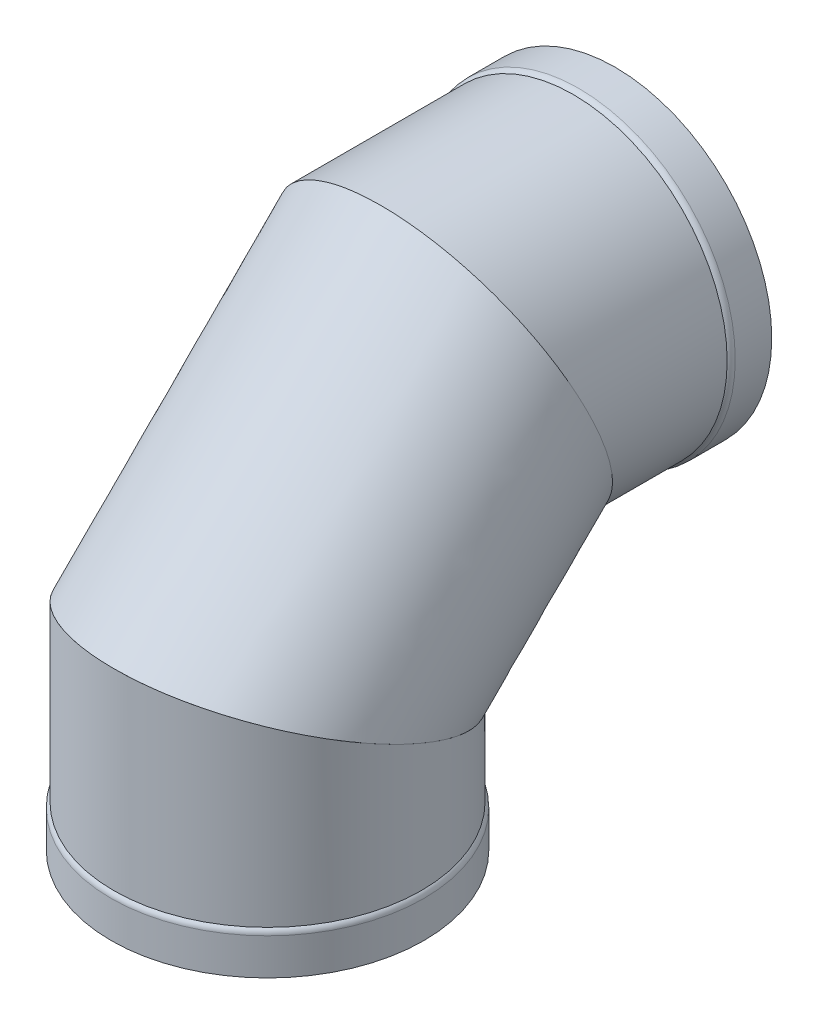
ISO-10303-21;
HEADER;
FILE_DESCRIPTION(('STEP AP214'),'2;1');
FILE_NAME('part.step','',(''),(''),'','','');
FILE_SCHEMA(('AUTOMOTIVE_DESIGN { 1 0 10303 214 1 1 1 1 }'));
ENDSEC;
DATA;
#1=APPLICATION_CONTEXT('core data for automotive mechanical design processes');
#2=APPLICATION_PROTOCOL_DEFINITION('international standard','automotive_design',2000,#1);
#3=PRODUCT_CONTEXT('',#1,'mechanical');
#4=PRODUCT('Part','Part','',(#3));
#5=PRODUCT_RELATED_PRODUCT_CATEGORY('part','',(#4));
#6=PRODUCT_DEFINITION_FORMATION('','',#4);
#7=PRODUCT_DEFINITION_CONTEXT('part definition',#1,'design');
#8=PRODUCT_DEFINITION('design','',#6,#7);
#9=PRODUCT_DEFINITION_SHAPE('','',#8);
#10=(LENGTH_UNIT() NAMED_UNIT(*) SI_UNIT(.MILLI.,.METRE.));
#11=(NAMED_UNIT(*) PLANE_ANGLE_UNIT() SI_UNIT($,.RADIAN.));
#12=(NAMED_UNIT(*) SI_UNIT($,.STERADIAN.) SOLID_ANGLE_UNIT());
#13=UNCERTAINTY_MEASURE_WITH_UNIT(LENGTH_MEASURE(1.E-05),#10,'distance_accuracy_value','');
#14=(GEOMETRIC_REPRESENTATION_CONTEXT(3) GLOBAL_UNCERTAINTY_ASSIGNED_CONTEXT((#13)) GLOBAL_UNIT_ASSIGNED_CONTEXT((#10,
#11,#12)) REPRESENTATION_CONTEXT('',''));
#15=CARTESIAN_POINT('',(0.,0.,0.));
#16=DIRECTION('',(0.,0.,1.));
#17=DIRECTION('',(1.,0.,0.));
#18=AXIS2_PLACEMENT_3D('',#15,#16,#17);
#19=CARTESIAN_POINT('',(0.,631.535476791397,-323.560476791396));
#20=DIRECTION('',(0.,-0.387588639363088,0.921832439566253));
#21=DIRECTION('',(0.,-0.921832439566253,-0.387588639363088));
#22=AXIS2_PLACEMENT_3D('',#19,#20,#21);
#23=PLANE('',#22);
#24=CARTESIAN_POINT('',(0.,631.535476791397,-323.560476791396));
#25=DIRECTION('',(0.,-0.387588639363088,0.921832439566253));
#26=DIRECTION('',(0.,-0.921832439566253,-0.387588639363088));
#27=AXIS2_PLACEMENT_3D('',#24,#25,#26);
#28=ELLIPSE('',#27,297.925618813354,274.6375);
#29=CARTESIAN_POINT('',(0.,356.897976791398,-439.03306201867));
#30=VERTEX_POINT('',#29);
#31=EDGE_CURVE('E91',#30,#30,#28,.T.);
#32=ORIENTED_EDGE('',*,*,#31,.T.);
#33=EDGE_LOOP('',(#32));
#34=FACE_BOUND('',#33,.T.);
#35=CARTESIAN_POINT('',(0.,631.535476791397,-323.560476791396));
#36=DIRECTION('',(0.,-0.387588639363088,0.921832439566253));
#37=DIRECTION('',(0.,-0.921832439566253,-0.387588639363088));
#38=AXIS2_PLACEMENT_3D('',#35,#36,#37);
#39=ELLIPSE('',#38,303.09195902399,279.4);
#40=CARTESIAN_POINT('',(0.,352.135476791397,-441.035476791397));
#41=VERTEX_POINT('',#40);
#42=EDGE_CURVE('E12',#41,#41,#39,.T.);
#43=ORIENTED_EDGE('',*,*,#42,.F.);
#44=EDGE_LOOP('',(#43));
#45=FACE_BOUND('',#44,.T.);
#46=ADVANCED_FACE('F74',(#34,#45),#23,.F.);
#47=CARTESIAN_POINT('',(0.,307.975,0.));
#48=DIRECTION('',(0.,0.921832439566255,-0.387588639363085));
#49=DIRECTION('',(0.,0.387588639363085,0.921832439566255));
#50=AXIS2_PLACEMENT_3D('',#47,#48,#49);
#51=PLANE('',#50);
#52=CARTESIAN_POINT('',(0.,307.975,0.));
#53=DIRECTION('',(0.,0.921832439566255,-0.387588639363085));
#54=DIRECTION('',(0.,-0.387588639363085,-0.921832439566255));
#55=AXIS2_PLACEMENT_3D('',#52,#53,#54);
#56=ELLIPSE('',#55,297.925618813354,274.6375);
#57=CARTESIAN_POINT('',(0.,192.502414772727,-274.6375));
#58=VERTEX_POINT('',#57);
#59=EDGE_CURVE('E105',#58,#58,#56,.T.);
#60=ORIENTED_EDGE('',*,*,#59,.T.);
#61=EDGE_LOOP('',(#60));
#62=FACE_BOUND('',#61,.T.);
#63=CARTESIAN_POINT('',(0.,307.975,0.));
#64=DIRECTION('',(0.,0.921832439566255,-0.387588639363085));
#65=DIRECTION('',(0.,-0.387588639363085,-0.921832439566255));
#66=AXIS2_PLACEMENT_3D('',#63,#64,#65);
#67=ELLIPSE('',#66,303.09195902399,279.4);
#68=CARTESIAN_POINT('',(0.,190.5,-279.4));
#69=VERTEX_POINT('',#68);
#70=EDGE_CURVE('E83',#69,#69,#67,.T.);
#71=ORIENTED_EDGE('',*,*,#70,.F.);
#72=EDGE_LOOP('',(#71));
#73=FACE_BOUND('',#72,.T.);
#74=ADVANCED_FACE('F113',(#62,#73),#51,.F.);
#75=CARTESIAN_POINT('',(0.0350124467390382,425.449999077625,279.399997806243));
#76=CARTESIAN_POINT('',(0.112525700537139,910.935454132066,-206.085486318613));
#77=CARTESIAN_POINT('',(558.835008059225,425.420556792867,279.329972912765));
#78=CARTESIAN_POINT('',(558.912480381876,910.710402730992,-206.180110203156));
#79=CARTESIAN_POINT('',(558.764983165747,190.470558637617,-279.470022699721));
#80=CARTESIAN_POINT('',(558.687428980802,351.910448049653,-441.130091148721));
#81=CARTESIAN_POINT('',(-0.0350124467391965,190.500000922375,-279.399997806243));
#82=CARTESIAN_POINT('',(-0.112525700537173,352.135499450728,-441.035467264178));
#83=CARTESIAN_POINT('',(-558.835008059225,190.529443207133,-279.329972912765));
#84=CARTESIAN_POINT('',(-558.912480381876,352.360550851802,-440.940843379636));
#85=CARTESIAN_POINT('',(-558.764983165747,425.479441362383,279.470022699721));
#86=CARTESIAN_POINT('',(-558.687428980802,911.160505533141,-205.99086243407));
#87=CARTESIAN_POINT('',(0.0350124467390382,425.449999077625,279.399997806243));
#88=CARTESIAN_POINT('',(0.112525700537139,910.935454132066,-206.085486318613));
#89=(BOUNDED_SURFACE() B_SPLINE_SURFACE(3,1,((#75,#76),(#77,#78),(#79,#80),(#81,#82),(#83,#84),
(#85,#86),(#87,#88)),.UNSPECIFIED.,.T.,.F.,.F.) B_SPLINE_SURFACE_WITH_KNOTS((4,3,4),(2,2),(0.,
0.5,1.),(0.,1.),.UNSPECIFIED.) GEOMETRIC_REPRESENTATION_ITEM() RATIONAL_B_SPLINE_SURFACE(((1.,
1.),(0.333333333333333,0.333333333333333),(0.333333333333333,0.333333333333333),(1.,1.),
(0.333333333333333,0.333333333333333),(0.333333333333333,0.333333333333333),(1.,1.))) REPRESENTATION_ITEM('') SURFACE());
#90=ORIENTED_EDGE('',*,*,#70,.T.);
#91=EDGE_LOOP('',(#90));
#92=FACE_BOUND('',#91,.T.);
#93=ORIENTED_EDGE('',*,*,#42,.T.);
#94=EDGE_LOOP('',(#93));
#95=FACE_BOUND('',#94,.T.);
#96=ADVANCED_FACE('F133',(#92,#95),#89,.T.);
#97=CARTESIAN_POINT('',(0.,192.502414772727,-274.6375));
#98=CARTESIAN_POINT('',(0.,356.897976791398,-439.03306201867));
#99=CARTESIAN_POINT('',(-549.275,192.502414772727,-274.6375));
#100=CARTESIAN_POINT('',(-549.275,356.897976791398,-439.03306201867));
#101=CARTESIAN_POINT('',(-549.275,423.447585227273,274.6375));
#102=CARTESIAN_POINT('',(-549.275,906.172976791397,-208.087891564122));
#103=CARTESIAN_POINT('',(0.,423.447585227273,274.6375));
#104=CARTESIAN_POINT('',(0.,906.172976791397,-208.087891564122));
#105=CARTESIAN_POINT('',(549.275,423.447585227273,274.6375));
#106=CARTESIAN_POINT('',(549.275,906.172976791397,-208.087891564122));
#107=CARTESIAN_POINT('',(549.275,192.502414772727,-274.6375));
#108=CARTESIAN_POINT('',(549.275,356.897976791398,-439.03306201867));
#109=CARTESIAN_POINT('',(0.,192.502414772727,-274.6375));
#110=CARTESIAN_POINT('',(0.,356.897976791398,-439.03306201867));
#111=(BOUNDED_SURFACE() B_SPLINE_SURFACE(3,1,((#97,#98),(#99,#100),(#101,#102),(#103,#104),
(#105,#106),(#107,#108),(#109,#110)),.UNSPECIFIED.,.T.,.F.,.F.) B_SPLINE_SURFACE_WITH_KNOTS((4,
3,4),(2,2),(0.,0.5,1.),(0.,1.),
.UNSPECIFIED.) GEOMETRIC_REPRESENTATION_ITEM() RATIONAL_B_SPLINE_SURFACE(((1.,1.),
(0.333333333333333,0.333333333333333),(0.333333333333333,0.333333333333333),(1.,1.),
(0.333333333333333,0.333333333333333),(0.333333333333333,0.333333333333333),(1.,1.))) REPRESENTATION_ITEM('') SURFACE());
#112=ORIENTED_EDGE('',*,*,#59,.F.);
#113=EDGE_LOOP('',(#112));
#114=FACE_BOUND('',#113,.T.);
#115=ORIENTED_EDGE('',*,*,#31,.F.);
#116=EDGE_LOOP('',(#115));
#117=FACE_BOUND('',#116,.T.);
#118=ADVANCED_FACE('F134',(#114,#117),#111,.F.);
#119=CLOSED_SHELL('',(#46,#74,#96,#118));
#120=MANIFOLD_SOLID_BREP('B2',#119);
#121=CARTESIAN_POINT('',(0.,631.535476791399,-683.649269894844));
#122=DIRECTION('',(0.,0.,-1.));
#123=DIRECTION('',(0.,-1.,0.));
#124=AXIS2_PLACEMENT_3D('',#121,#122,#123);
#125=CYLINDRICAL_SURFACE('',#124,279.4);
#126=CARTESIAN_POINT('',(0.,631.535476791398,-555.335476791396));
#127=DIRECTION('',(0.,0.,1.));
#128=DIRECTION('',(0.,-1.,0.));
#129=AXIS2_PLACEMENT_3D('',#126,#127,#128);
#130=CIRCLE('',#129,279.4);
#131=CARTESIAN_POINT('',(0.,352.135476791398,-555.335476791397));
#132=VERTEX_POINT('',#131);
#133=EDGE_CURVE('E275',#132,#132,#130,.T.);
#134=ORIENTED_EDGE('',*,*,#133,.T.);
#135=EDGE_LOOP('',(#134));
#136=FACE_BOUND('',#135,.T.);
#137=CARTESIAN_POINT('',(0.,631.535476791397,-323.560476791396));
#138=DIRECTION('',(0.,-0.387588639363088,0.921832439566253));
#139=DIRECTION('',(0.,-0.921832439566253,-0.387588639363088));
#140=AXIS2_PLACEMENT_3D('',#137,#138,#139);
#141=ELLIPSE('',#140,303.09195902399,279.4);
#142=CARTESIAN_POINT('',(0.,352.135476791397,-441.035476791397));
#143=VERTEX_POINT('',#142);
#144=EDGE_CURVE('E287',#143,#143,#141,.T.);
#145=ORIENTED_EDGE('',*,*,#144,.F.);
#146=EDGE_LOOP('',(#145));
#147=FACE_BOUND('',#146,.T.);
#148=ADVANCED_FACE('F261',(#136,#147),#125,.T.);
#149=CARTESIAN_POINT('',(0.,631.535476791399,-683.649269894844));
#150=DIRECTION('',(0.,0.,-1.));
#151=DIRECTION('',(0.,-1.,0.));
#152=AXIS2_PLACEMENT_3D('',#149,#150,#151);
#153=CYLINDRICAL_SURFACE('',#152,284.1625);
#154=CARTESIAN_POINT('',(0.,631.535476791398,-565.249411113853));
#155=DIRECTION('',(0.,0.,1.));
#156=DIRECTION('',(0.,-1.,0.));
#157=AXIS2_PLACEMENT_3D('',#154,#155,#156);
#158=CIRCLE('',#157,284.1625);
#159=CARTESIAN_POINT('',(0.,347.372976791398,-565.249411113854));
#160=VERTEX_POINT('',#159);
#161=EDGE_CURVE('E269',#160,#160,#158,.F.);
#162=ORIENTED_EDGE('',*,*,#161,.T.);
#163=EDGE_LOOP('',(#162));
#164=FACE_BOUND('',#163,.T.);
#165=CARTESIAN_POINT('',(0.,631.535476791398,-631.535476791396));
#166=DIRECTION('',(0.,0.,1.));
#167=DIRECTION('',(0.,-1.,0.));
#168=AXIS2_PLACEMENT_3D('',#165,#166,#167);
#169=CIRCLE('',#168,284.1625);
#170=CARTESIAN_POINT('',(0.,347.372976791398,-631.535476791397));
#171=VERTEX_POINT('',#170);
#172=EDGE_CURVE('E281',#171,#171,#169,.T.);
#173=ORIENTED_EDGE('',*,*,#172,.T.);
#174=EDGE_LOOP('',(#173));
#175=FACE_BOUND('',#174,.T.);
#176=ADVANCED_FACE('F308',(#164,#175),#153,.T.);
#177=CARTESIAN_POINT('',(0.,915.697976791398,-631.535476791395));
#178=DIRECTION('',(0.,0.,1.));
#179=DIRECTION('',(0.,1.,0.));
#180=AXIS2_PLACEMENT_3D('',#177,#178,#179);
#181=PLANE('',#180);
#182=CARTESIAN_POINT('',(0.,631.535476791398,-631.535476791396));
#183=DIRECTION('',(0.,0.,1.));
#184=DIRECTION('',(0.,-1.,0.));
#185=AXIS2_PLACEMENT_3D('',#182,#183,#184);
#186=CIRCLE('',#185,279.4);
#187=CARTESIAN_POINT('',(0.,352.135476791398,-631.535476791397));
#188=VERTEX_POINT('',#187);
#189=EDGE_CURVE('E292',#188,#188,#186,.T.);
#190=ORIENTED_EDGE('',*,*,#189,.T.);
#191=EDGE_LOOP('',(#190));
#192=FACE_BOUND('',#191,.T.);
#193=ORIENTED_EDGE('',*,*,#172,.F.);
#194=EDGE_LOOP('',(#193));
#195=FACE_BOUND('',#194,.T.);
#196=ADVANCED_FACE('F314',(#192,#195),#181,.F.);
#197=CARTESIAN_POINT('',(0.,631.535476791399,-683.649269894844));
#198=DIRECTION('',(0.,0.,-1.));
#199=DIRECTION('',(0.,-1.,0.));
#200=AXIS2_PLACEMENT_3D('',#197,#198,#199);
#201=CYLINDRICAL_SURFACE('',#200,279.4);
#202=CARTESIAN_POINT('',(0.,631.535476791398,-570.011911113853));
#203=DIRECTION('',(0.,0.,1.));
#204=DIRECTION('',(0.,-1.,0.));
#205=AXIS2_PLACEMENT_3D('',#202,#203,#204);
#206=CIRCLE('',#205,279.4);
#207=CARTESIAN_POINT('',(0.,352.135476791398,-570.011911113854));
#208=VERTEX_POINT('',#207);
#209=EDGE_CURVE('E73',#208,#208,#206,.T.);
#210=ORIENTED_EDGE('',*,*,#209,.T.);
#211=EDGE_LOOP('',(#210));
#212=FACE_BOUND('',#211,.T.);
#213=ORIENTED_EDGE('',*,*,#189,.F.);
#214=EDGE_LOOP('',(#213));
#215=FACE_BOUND('',#214,.T.);
#216=ADVANCED_FACE('F333',(#212,#215),#201,.F.);
#217=CARTESIAN_POINT('',(0.,631.535476791399,-683.649269894844));
#218=DIRECTION('',(0.,0.,-1.));
#219=DIRECTION('',(0.,-1.,0.));
#220=AXIS2_PLACEMENT_3D('',#217,#218,#219);
#221=CYLINDRICAL_SURFACE('',#220,274.6375);
#222=CARTESIAN_POINT('',(0.,631.535476791397,-323.560476791396));
#223=DIRECTION('',(0.,-0.387588639363088,0.921832439566253));
#224=DIRECTION('',(0.,-0.921832439566253,-0.387588639363088));
#225=AXIS2_PLACEMENT_3D('',#222,#223,#224);
#226=ELLIPSE('',#225,297.925618813354,274.6375);
#227=CARTESIAN_POINT('',(0.,356.897976791397,-439.03306201867));
#228=VERTEX_POINT('',#227);
#229=EDGE_CURVE('E284',#228,#228,#226,.F.);
#230=ORIENTED_EDGE('',*,*,#229,.F.);
#231=EDGE_LOOP('',(#230));
#232=FACE_BOUND('',#231,.T.);
#233=CARTESIAN_POINT('',(0.,631.535476791398,-560.097976791396));
#234=DIRECTION('',(0.,0.,1.));
#235=DIRECTION('',(0.,-1.,0.));
#236=AXIS2_PLACEMENT_3D('',#233,#234,#235);
#237=CIRCLE('',#236,274.6375);
#238=CARTESIAN_POINT('',(0.,356.897976791398,-560.097976791397));
#239=VERTEX_POINT('',#238);
#240=EDGE_CURVE('E296',#239,#239,#237,.T.);
#241=ORIENTED_EDGE('',*,*,#240,.F.);
#242=EDGE_LOOP('',(#241));
#243=FACE_BOUND('',#242,.T.);
#244=ADVANCED_FACE('F325',(#232,#243),#221,.F.);
#245=CARTESIAN_POINT('',(-284.1625,910.935476791397,-206.085476791395));
#246=DIRECTION('',(0.,0.387588639363088,-0.921832439566253));
#247=DIRECTION('',(0.,-0.921832439566253,-0.387588639363088));
#248=AXIS2_PLACEMENT_3D('',#245,#246,#247);
#249=PLANE('',#248);
#250=ORIENTED_EDGE('',*,*,#229,.T.);
#251=EDGE_LOOP('',(#250));
#252=FACE_BOUND('',#251,.T.);
#253=ORIENTED_EDGE('',*,*,#144,.T.);
#254=EDGE_LOOP('',(#253));
#255=FACE_BOUND('',#254,.T.);
#256=ADVANCED_FACE('F305',(#252,#255),#249,.F.);
#257=CARTESIAN_POINT('',(0.,631.535476791398,-565.249411113853));
#258=DIRECTION('',(0.,0.,1.));
#259=DIRECTION('',(0.,-1.,0.));
#260=AXIS2_PLACEMENT_3D('',#257,#258,#259);
#261=TOROIDAL_SURFACE('',#260,271.4625,12.7);
#262=ORIENTED_EDGE('',*,*,#161,.F.);
#263=EDGE_LOOP('',(#262));
#264=FACE_BOUND('',#263,.T.);
#265=ORIENTED_EDGE('',*,*,#133,.F.);
#266=EDGE_LOOP('',(#265));
#267=FACE_BOUND('',#266,.T.);
#268=ADVANCED_FACE('F317',(#264,#267),#261,.T.);
#269=CARTESIAN_POINT('',(0.,631.535476791398,-570.011911113853));
#270=DIRECTION('',(0.,0.,1.));
#271=DIRECTION('',(0.,-1.,0.));
#272=AXIS2_PLACEMENT_3D('',#269,#270,#271);
#273=TOROIDAL_SURFACE('',#272,266.7,12.7);
#274=ORIENTED_EDGE('',*,*,#240,.T.);
#275=EDGE_LOOP('',(#274));
#276=FACE_BOUND('',#275,.T.);
#277=ORIENTED_EDGE('',*,*,#209,.F.);
#278=EDGE_LOOP('',(#277));
#279=FACE_BOUND('',#278,.T.);
#280=ADVANCED_FACE('F263',(#276,#279),#273,.F.);
#281=CLOSED_SHELL('',(#148,#176,#196,#216,#244,#256,#268,#280));
#282=MANIFOLD_SOLID_BREP('B7',#281);
#283=CARTESIAN_POINT('',(0.,-52.1137931034483,0.));
#284=DIRECTION('',(0.,-1.,0.));
#285=DIRECTION('',(0.,0.,-1.));
#286=AXIS2_PLACEMENT_3D('',#283,#284,#285);
#287=CYLINDRICAL_SURFACE('',#286,279.4);
#288=CARTESIAN_POINT('',(0.,76.2,0.));
#289=DIRECTION('',(0.,-1.,0.));
#290=DIRECTION('',(0.,0.,-1.));
#291=AXIS2_PLACEMENT_3D('',#288,#289,#290);
#292=CIRCLE('',#291,279.4);
#293=CARTESIAN_POINT('',(0.,76.2,-279.4));
#294=VERTEX_POINT('',#293);
#295=EDGE_CURVE('E429',#294,#294,#292,.T.);
#296=ORIENTED_EDGE('',*,*,#295,.F.);
#297=EDGE_LOOP('',(#296));
#298=FACE_BOUND('',#297,.T.);
#299=CARTESIAN_POINT('',(0.,307.975,0.));
#300=DIRECTION('',(0.,-0.921832439566255,0.387588639363084));
#301=DIRECTION('',(0.,-0.387588639363085,-0.921832439566255));
#302=AXIS2_PLACEMENT_3D('',#299,#300,#301);
#303=ELLIPSE('',#302,303.09195902399,279.4);
#304=CARTESIAN_POINT('',(0.,190.5,-279.4));
#305=VERTEX_POINT('',#304);
#306=EDGE_CURVE('E441',#305,#305,#303,.T.);
#307=ORIENTED_EDGE('',*,*,#306,.T.);
#308=EDGE_LOOP('',(#307));
#309=FACE_BOUND('',#308,.T.);
#310=ADVANCED_FACE('F415',(#298,#309),#287,.T.);
#311=CARTESIAN_POINT('',(0.,-52.1137931034483,0.));
#312=DIRECTION('',(0.,-1.,0.));
#313=DIRECTION('',(0.,0.,-1.));
#314=AXIS2_PLACEMENT_3D('',#311,#312,#313);
#315=CYLINDRICAL_SURFACE('',#314,284.1625);
#316=CARTESIAN_POINT('',(0.,66.2860656775425,0.));
#317=DIRECTION('',(0.,1.,0.));
#318=DIRECTION('',(0.,0.,1.));
#319=AXIS2_PLACEMENT_3D('',#316,#317,#318);
#320=CIRCLE('',#319,284.1625);
#321=CARTESIAN_POINT('',(0.,66.2860656775425,284.1625));
#322=VERTEX_POINT('',#321);
#323=EDGE_CURVE('E260',#322,#322,#320,.F.);
#324=ORIENTED_EDGE('',*,*,#323,.T.);
#325=EDGE_LOOP('',(#324));
#326=FACE_BOUND('',#325,.T.);
#327=CARTESIAN_POINT('',(0.,0.,0.));
#328=DIRECTION('',(0.,-1.,0.));
#329=DIRECTION('',(0.,0.,-1.));
#330=AXIS2_PLACEMENT_3D('',#327,#328,#329);
#331=CIRCLE('',#330,284.1625);
#332=CARTESIAN_POINT('',(0.,0.,-284.1625));
#333=VERTEX_POINT('',#332);
#334=EDGE_CURVE('E435',#333,#333,#331,.T.);
#335=ORIENTED_EDGE('',*,*,#334,.F.);
#336=EDGE_LOOP('',(#335));
#337=FACE_BOUND('',#336,.T.);
#338=ADVANCED_FACE('F476',(#326,#337),#315,.T.);
#339=CARTESIAN_POINT('',(0.,0.,284.1625));
#340=DIRECTION('',(0.,1.,0.));
#341=DIRECTION('',(0.,0.,1.));
#342=AXIS2_PLACEMENT_3D('',#339,#340,#341);
#343=PLANE('',#342);
#344=CARTESIAN_POINT('',(0.,0.,0.));
#345=DIRECTION('',(0.,-1.,0.));
#346=DIRECTION('',(0.,0.,-1.));
#347=AXIS2_PLACEMENT_3D('',#344,#345,#346);
#348=CIRCLE('',#347,279.4);
#349=CARTESIAN_POINT('',(0.,0.,-279.4));
#350=VERTEX_POINT('',#349);
#351=EDGE_CURVE('E446',#350,#350,#348,.T.);
#352=ORIENTED_EDGE('',*,*,#351,.F.);
#353=EDGE_LOOP('',(#352));
#354=FACE_BOUND('',#353,.T.);
#355=ORIENTED_EDGE('',*,*,#334,.T.);
#356=EDGE_LOOP('',(#355));
#357=FACE_BOUND('',#356,.T.);
#358=ADVANCED_FACE('F482',(#354,#357),#343,.F.);
#359=CARTESIAN_POINT('',(0.,-52.1137931034483,0.));
#360=DIRECTION('',(0.,-1.,0.));
#361=DIRECTION('',(0.,0.,-1.));
#362=AXIS2_PLACEMENT_3D('',#359,#360,#361);
#363=CYLINDRICAL_SURFACE('',#362,279.4);
#364=CARTESIAN_POINT('',(0.,61.5235656775425,0.));
#365=DIRECTION('',(0.,1.,0.));
#366=DIRECTION('',(0.,0.,1.));
#367=AXIS2_PLACEMENT_3D('',#364,#365,#366);
#368=CIRCLE('',#367,279.4);
#369=CARTESIAN_POINT('',(0.,61.5235656775425,279.4));
#370=VERTEX_POINT('',#369);
#371=EDGE_CURVE('E423',#370,#370,#368,.T.);
#372=ORIENTED_EDGE('',*,*,#371,.T.);
#373=EDGE_LOOP('',(#372));
#374=FACE_BOUND('',#373,.T.);
#375=ORIENTED_EDGE('',*,*,#351,.T.);
#376=EDGE_LOOP('',(#375));
#377=FACE_BOUND('',#376,.T.);
#378=ADVANCED_FACE('F471',(#374,#377),#363,.F.);
#379=CARTESIAN_POINT('',(0.,-52.1137931034483,0.));
#380=DIRECTION('',(0.,-1.,0.));
#381=DIRECTION('',(0.,0.,-1.));
#382=AXIS2_PLACEMENT_3D('',#379,#380,#381);
#383=CYLINDRICAL_SURFACE('',#382,274.6375);
#384=CARTESIAN_POINT('',(0.,307.975,0.));
#385=DIRECTION('',(0.,-0.921832439566255,0.387588639363084));
#386=DIRECTION('',(0.,-0.387588639363085,-0.921832439566255));
#387=AXIS2_PLACEMENT_3D('',#384,#385,#386);
#388=ELLIPSE('',#387,297.925618813354,274.6375);
#389=CARTESIAN_POINT('',(0.,192.502414772727,-274.6375));
#390=VERTEX_POINT('',#389);
#391=EDGE_CURVE('E438',#390,#390,#388,.F.);
#392=ORIENTED_EDGE('',*,*,#391,.T.);
#393=EDGE_LOOP('',(#392));
#394=FACE_BOUND('',#393,.T.);
#395=CARTESIAN_POINT('',(0.,71.4375,0.));
#396=DIRECTION('',(0.,-1.,0.));
#397=DIRECTION('',(0.,0.,-1.));
#398=AXIS2_PLACEMENT_3D('',#395,#396,#397);
#399=CIRCLE('',#398,274.6375);
#400=CARTESIAN_POINT('',(0.,71.4375,-274.6375));
#401=VERTEX_POINT('',#400);
#402=EDGE_CURVE('E450',#401,#401,#399,.T.);
#403=ORIENTED_EDGE('',*,*,#402,.T.);
#404=EDGE_LOOP('',(#403));
#405=FACE_BOUND('',#404,.T.);
#406=ADVANCED_FACE('F463',(#394,#405),#383,.F.);
#407=CARTESIAN_POINT('',(-284.1625,425.45,279.4));
#408=DIRECTION('',(0.,-0.921832439566255,0.387588639363084));
#409=DIRECTION('',(0.,-0.387588639363085,-0.921832439566255));
#410=AXIS2_PLACEMENT_3D('',#407,#408,#409);
#411=PLANE('',#410);
#412=ORIENTED_EDGE('',*,*,#391,.F.);
#413=EDGE_LOOP('',(#412));
#414=FACE_BOUND('',#413,.T.);
#415=ORIENTED_EDGE('',*,*,#306,.F.);
#416=EDGE_LOOP('',(#415));
#417=FACE_BOUND('',#416,.T.);
#418=ADVANCED_FACE('F460',(#414,#417),#411,.F.);
#419=CARTESIAN_POINT('',(0.,61.5235656775425,0.));
#420=DIRECTION('',(0.,1.,0.));
#421=DIRECTION('',(0.,0.,1.));
#422=AXIS2_PLACEMENT_3D('',#419,#420,#421);
#423=TOROIDAL_SURFACE('',#422,266.7,12.7);
#424=ORIENTED_EDGE('',*,*,#371,.F.);
#425=EDGE_LOOP('',(#424));
#426=FACE_BOUND('',#425,.T.);
#427=ORIENTED_EDGE('',*,*,#402,.F.);
#428=EDGE_LOOP('',(#427));
#429=FACE_BOUND('',#428,.T.);
#430=ADVANCED_FACE('F462',(#426,#429),#423,.F.);
#431=CARTESIAN_POINT('',(0.,66.2860656775425,0.));
#432=DIRECTION('',(0.,1.,0.));
#433=DIRECTION('',(0.,0.,1.));
#434=AXIS2_PLACEMENT_3D('',#431,#432,#433);
#435=TOROIDAL_SURFACE('',#434,271.4625,12.7);
#436=ORIENTED_EDGE('',*,*,#295,.T.);
#437=EDGE_LOOP('',(#436));
#438=FACE_BOUND('',#437,.T.);
#439=ORIENTED_EDGE('',*,*,#323,.F.);
#440=EDGE_LOOP('',(#439));
#441=FACE_BOUND('',#440,.T.);
#442=ADVANCED_FACE('F417',(#438,#441),#435,.T.);
#443=CLOSED_SHELL('',(#310,#338,#358,#378,#406,#418,#430,#442));
#444=MANIFOLD_SOLID_BREP('B68',#443);
#445=ADVANCED_BREP_SHAPE_REPRESENTATION('',(#18,#120,#282,#444),#14);
#446=SHAPE_DEFINITION_REPRESENTATION(#9,#445);
ENDSEC;
END-ISO-10303-21;
